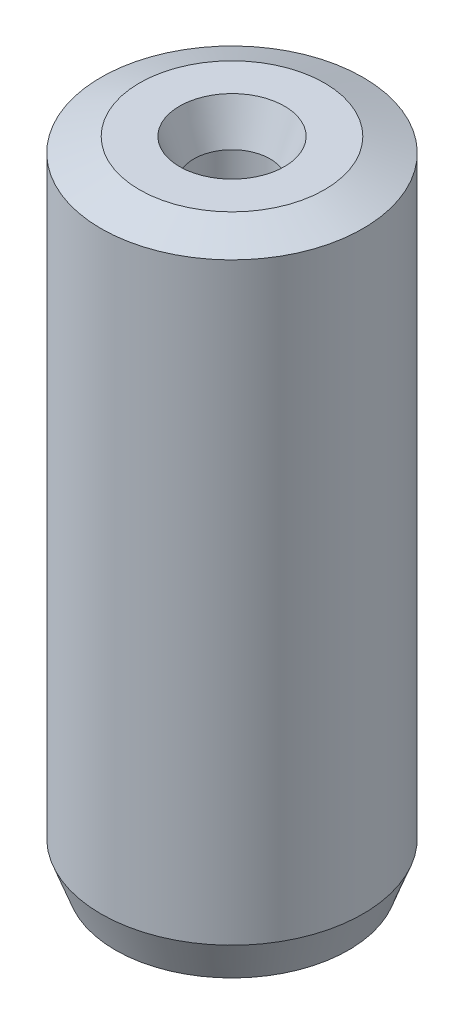
ISO-10303-21;
HEADER;
FILE_DESCRIPTION(('STEP AP214'),'2;1');
FILE_NAME('part.step','',(''),(''),'','','');
FILE_SCHEMA(('AUTOMOTIVE_DESIGN { 1 0 10303 214 1 1 1 1 }'));
ENDSEC;
DATA;
#1=APPLICATION_CONTEXT('core data for automotive mechanical design processes');
#2=APPLICATION_PROTOCOL_DEFINITION('international standard','automotive_design',2000,#1);
#3=PRODUCT_CONTEXT('',#1,'mechanical');
#4=PRODUCT('Part','Part','',(#3));
#5=PRODUCT_RELATED_PRODUCT_CATEGORY('part','',(#4));
#6=PRODUCT_DEFINITION_FORMATION('','',#4);
#7=PRODUCT_DEFINITION_CONTEXT('part definition',#1,'design');
#8=PRODUCT_DEFINITION('design','',#6,#7);
#9=PRODUCT_DEFINITION_SHAPE('','',#8);
#10=(LENGTH_UNIT() NAMED_UNIT(*) SI_UNIT(.MILLI.,.METRE.));
#11=(NAMED_UNIT(*) PLANE_ANGLE_UNIT() SI_UNIT($,.RADIAN.));
#12=(NAMED_UNIT(*) SI_UNIT($,.STERADIAN.) SOLID_ANGLE_UNIT());
#13=UNCERTAINTY_MEASURE_WITH_UNIT(LENGTH_MEASURE(1.E-05),#10,'distance_accuracy_value','');
#14=(GEOMETRIC_REPRESENTATION_CONTEXT(3) GLOBAL_UNCERTAINTY_ASSIGNED_CONTEXT((#13)) GLOBAL_UNIT_ASSIGNED_CONTEXT((#10,
#11,#12)) REPRESENTATION_CONTEXT('',''));
#15=CARTESIAN_POINT('',(0.,0.,0.));
#16=DIRECTION('',(0.,0.,1.));
#17=DIRECTION('',(1.,0.,0.));
#18=AXIS2_PLACEMENT_3D('',#15,#16,#17);
#19=CARTESIAN_POINT('',(0.,24.6691971817461,0.));
#20=DIRECTION('',(0.,-1.,0.));
#21=DIRECTION('',(0.,0.,-1.));
#22=AXIS2_PLACEMENT_3D('',#19,#20,#21);
#23=CYLINDRICAL_SURFACE('',#22,5.);
#24=CARTESIAN_POINT('',(0.,1.4690033079878,0.));
#25=DIRECTION('',(0.,1.,0.));
#26=DIRECTION('',(0.,0.,1.));
#27=AXIS2_PLACEMENT_3D('',#24,#25,#26);
#28=CIRCLE('',#27,5.);
#29=CARTESIAN_POINT('',(0.,1.4690033079878,5.));
#30=VERTEX_POINT('',#29);
#31=EDGE_CURVE('E10',#30,#30,#28,.T.);
#32=ORIENTED_EDGE('',*,*,#31,.T.);
#33=EDGE_LOOP('',(#32));
#34=FACE_BOUND('',#33,.T.);
#35=CARTESIAN_POINT('',(0.,24.1210918360298,0.));
#36=DIRECTION('',(0.,1.,0.));
#37=DIRECTION('',(0.,0.,1.));
#38=AXIS2_PLACEMENT_3D('',#35,#36,#37);
#39=CIRCLE('',#38,5.);
#40=CARTESIAN_POINT('',(0.,24.1210918360298,-5.));
#41=VERTEX_POINT('',#40);
#42=EDGE_CURVE('E50',#41,#41,#39,.F.);
#43=ORIENTED_EDGE('',*,*,#42,.T.);
#44=EDGE_LOOP('',(#43));
#45=FACE_BOUND('',#44,.T.);
#46=ADVANCED_FACE('F39',(#34,#45),#23,.T.);
#47=CARTESIAN_POINT('',(0.,24.6691971817461,0.));
#48=DIRECTION('',(0.,1.,0.));
#49=DIRECTION('',(0.,0.,1.));
#50=AXIS2_PLACEMENT_3D('',#47,#48,#49);
#51=PLANE('',#50);
#52=CARTESIAN_POINT('',(0.,24.6691971817461,0.));
#53=DIRECTION('',(0.,1.,0.));
#54=DIRECTION('',(0.,0.,1.));
#55=AXIS2_PLACEMENT_3D('',#52,#53,#54);
#56=CIRCLE('',#55,2.00139401662723);
#57=CARTESIAN_POINT('',(0.,24.6691971817461,2.00139401662723));
#58=VERTEX_POINT('',#57);
#59=EDGE_CURVE('E58',#58,#58,#56,.F.);
#60=ORIENTED_EDGE('',*,*,#59,.T.);
#61=EDGE_LOOP('',(#60));
#62=FACE_BOUND('',#61,.T.);
#63=CARTESIAN_POINT('',(0.,24.6691971817461,0.));
#64=DIRECTION('',(0.,1.,0.));
#65=DIRECTION('',(0.,0.,1.));
#66=AXIS2_PLACEMENT_3D('',#63,#64,#65);
#67=CIRCLE('',#66,3.53099669201218);
#68=CARTESIAN_POINT('',(0.,24.6691971817461,-3.53099669201218));
#69=VERTEX_POINT('',#68);
#70=EDGE_CURVE('E61',#69,#69,#67,.T.);
#71=ORIENTED_EDGE('',*,*,#70,.T.);
#72=EDGE_LOOP('',(#71));
#73=FACE_BOUND('',#72,.T.);
#74=ADVANCED_FACE('F88',(#62,#73),#51,.T.);
#75=CARTESIAN_POINT('',(0.,0.,0.));
#76=DIRECTION('',(0.,1.,0.));
#77=DIRECTION('',(0.,0.,1.));
#78=AXIS2_PLACEMENT_3D('',#75,#76,#77);
#79=PLANE('',#78);
#80=CARTESIAN_POINT('',(0.,0.,0.));
#81=DIRECTION('',(0.,1.,0.));
#82=DIRECTION('',(0.,0.,1.));
#83=AXIS2_PLACEMENT_3D('',#80,#81,#82);
#84=CIRCLE('',#83,2.92229197889871);
#85=CARTESIAN_POINT('',(0.,0.,-2.92229197889871));
#86=VERTEX_POINT('',#85);
#87=EDGE_CURVE('E51',#86,#86,#84,.T.);
#88=ORIENTED_EDGE('',*,*,#87,.T.);
#89=EDGE_LOOP('',(#88));
#90=FACE_BOUND('',#89,.T.);
#91=CARTESIAN_POINT('',(0.,0.,0.));
#92=DIRECTION('',(0.,1.,0.));
#93=DIRECTION('',(0.,0.,1.));
#94=AXIS2_PLACEMENT_3D('',#91,#92,#93);
#95=CIRCLE('',#94,4.45189465428366);
#96=CARTESIAN_POINT('',(0.,0.,4.45189465428366));
#97=VERTEX_POINT('',#96);
#98=EDGE_CURVE('E54',#97,#97,#95,.F.);
#99=ORIENTED_EDGE('',*,*,#98,.T.);
#100=EDGE_LOOP('',(#99));
#101=FACE_BOUND('',#100,.T.);
#102=ADVANCED_FACE('F83',(#90,#101),#79,.F.);
#103=CARTESIAN_POINT('',(0.,24.6691971817461,0.));
#104=DIRECTION('',(0.,-1.,0.));
#105=DIRECTION('',(0.,0.,-1.));
#106=AXIS2_PLACEMENT_3D('',#103,#104,#105);
#107=CYLINDRICAL_SURFACE('',#106,1.45328867091089);
#108=CARTESIAN_POINT('',(0.,23.2001938737583,0.));
#109=DIRECTION('',(0.,1.,0.));
#110=DIRECTION('',(0.,0.,1.));
#111=AXIS2_PLACEMENT_3D('',#108,#109,#110);
#112=CIRCLE('',#111,1.45328867091089);
#113=CARTESIAN_POINT('',(0.,23.2001938737583,1.45328867091089));
#114=VERTEX_POINT('',#113);
#115=EDGE_CURVE('E67',#114,#114,#112,.T.);
#116=ORIENTED_EDGE('',*,*,#115,.T.);
#117=EDGE_LOOP('',(#116));
#118=FACE_BOUND('',#117,.T.);
#119=CARTESIAN_POINT('',(0.,0.548105345716348,0.));
#120=DIRECTION('',(0.,1.,0.));
#121=DIRECTION('',(0.,0.,1.));
#122=AXIS2_PLACEMENT_3D('',#119,#120,#121);
#123=CIRCLE('',#122,1.45328867091089);
#124=CARTESIAN_POINT('',(0.,0.548105345716348,-1.45328867091089));
#125=VERTEX_POINT('',#124);
#126=EDGE_CURVE('E69',#125,#125,#123,.F.);
#127=ORIENTED_EDGE('',*,*,#126,.T.);
#128=EDGE_LOOP('',(#127));
#129=FACE_BOUND('',#128,.T.);
#130=ADVANCED_FACE('F71',(#118,#129),#107,.F.);
#131=CARTESIAN_POINT('',(0.,23.2001938737583,0.));
#132=DIRECTION('',(0.,1.,0.));
#133=DIRECTION('',(0.,0.,1.));
#134=AXIS2_PLACEMENT_3D('',#131,#132,#133);
#135=CONICAL_SURFACE('',#134,1.45328867091089,0.357115954589851);
#136=ORIENTED_EDGE('',*,*,#59,.F.);
#137=EDGE_LOOP('',(#136));
#138=FACE_BOUND('',#137,.T.);
#139=ORIENTED_EDGE('',*,*,#115,.F.);
#140=EDGE_LOOP('',(#139));
#141=FACE_BOUND('',#140,.T.);
#142=ADVANCED_FACE('F77',(#138,#141),#135,.F.);
#143=CARTESIAN_POINT('',(0.,0.,0.));
#144=DIRECTION('',(0.,-1.,0.));
#145=DIRECTION('',(0.,0.,-1.));
#146=AXIS2_PLACEMENT_3D('',#143,#144,#145);
#147=CONICAL_SURFACE('',#146,2.92229197889871,1.21368037220505);
#148=CARTESIAN_POINT('',(0.,0.548105345716348,-1.45328867091089));
#149=CARTESIAN_POINT('',(0.,0.542395915031803,-1.46859078870243));
#150=CARTESIAN_POINT('',(0.,0.536686484347257,-1.48389290649397));
#151=CARTESIAN_POINT('',(0.,0.525267622978167,-1.51449714207705));
#152=CARTESIAN_POINT('',(0.,0.519558192293622,-1.52979925986859));
#153=CARTESIAN_POINT('',(0.,0.508139330924531,-1.56040349545167));
#154=CARTESIAN_POINT('',(0.,0.502429900239986,-1.57570561324321));
#155=CARTESIAN_POINT('',(0.,0.491011038870895,-1.60630984882629));
#156=CARTESIAN_POINT('',(0.,0.48530160818635,-1.62161196661783));
#157=CARTESIAN_POINT('',(0.,0.473882746817259,-1.65221620220091));
#158=CARTESIAN_POINT('',(0.,0.468173316132714,-1.66751831999245));
#159=CARTESIAN_POINT('',(0.,0.456754454763623,-1.69812255557552));
#160=CARTESIAN_POINT('',(0.,0.451045024079078,-1.71342467336706));
#161=CARTESIAN_POINT('',(0.,0.439626162709987,-1.74402890895014));
#162=CARTESIAN_POINT('',(0.,0.433916732025442,-1.75933102674168));
#163=CARTESIAN_POINT('',(0.,0.422497870656352,-1.78993526232476));
#164=CARTESIAN_POINT('',(0.,0.416788439971806,-1.8052373801163));
#165=CARTESIAN_POINT('',(0.,0.405369578602716,-1.83584161569938));
#166=CARTESIAN_POINT('',(0.,0.39966014791817,-1.85114373349092));
#167=CARTESIAN_POINT('',(0.,0.38824128654908,-1.881747969074));
#168=CARTESIAN_POINT('',(0.,0.382531855864534,-1.89705008686554));
#169=CARTESIAN_POINT('',(0.,0.371112994495444,-1.92765432244862));
#170=CARTESIAN_POINT('',(0.,0.365403563810899,-1.94295644024016));
#171=CARTESIAN_POINT('',(0.,0.353984702441808,-1.97356067582324));
#172=CARTESIAN_POINT('',(0.,0.348275271757263,-1.98886279361478));
#173=CARTESIAN_POINT('',(0.,0.336856410388172,-2.01946702919786));
#174=CARTESIAN_POINT('',(0.,0.331146979703627,-2.0347691469894));
#175=CARTESIAN_POINT('',(0.,0.319728118334536,-2.06537338257248));
#176=CARTESIAN_POINT('',(0.,0.314018687649991,-2.08067550036402));
#177=CARTESIAN_POINT('',(0.,0.3025998262809,-2.1112797359471));
#178=CARTESIAN_POINT('',(0.,0.296890395596355,-2.12658185373864));
#179=CARTESIAN_POINT('',(0.,0.285471534227265,-2.15718608932172));
#180=CARTESIAN_POINT('',(0.,0.279762103542719,-2.17248820711326));
#181=CARTESIAN_POINT('',(0.,0.268343242173629,-2.20309244269634));
#182=CARTESIAN_POINT('',(0.,0.262633811489083,-2.21839456048788));
#183=CARTESIAN_POINT('',(0.,0.251214950119993,-2.24899879607096));
#184=CARTESIAN_POINT('',(0.,0.245505519435447,-2.2643009138625));
#185=CARTESIAN_POINT('',(0.,0.234086658066357,-2.29490514944558));
#186=CARTESIAN_POINT('',(0.,0.228377227381812,-2.31020726723712));
#187=CARTESIAN_POINT('',(0.,0.216958366012721,-2.3408115028202));
#188=CARTESIAN_POINT('',(0.,0.211248935328176,-2.35611362061174));
#189=CARTESIAN_POINT('',(0.,0.199830073959085,-2.38671785619482));
#190=CARTESIAN_POINT('',(0.,0.19412064327454,-2.40201997398636));
#191=CARTESIAN_POINT('',(0.,0.182701781905449,-2.43262420956944));
#192=CARTESIAN_POINT('',(0.,0.176992351220904,-2.44792632736098));
#193=CARTESIAN_POINT('',(0.,0.165573489851813,-2.47853056294405));
#194=CARTESIAN_POINT('',(0.,0.159864059167268,-2.49383268073559));
#195=CARTESIAN_POINT('',(0.,0.148445197798178,-2.52443691631867));
#196=CARTESIAN_POINT('',(0.,0.142735767113632,-2.53973903411021));
#197=CARTESIAN_POINT('',(0.,0.131316905744542,-2.57034326969329));
#198=CARTESIAN_POINT('',(0.,0.125607475059996,-2.58564538748483));
#199=CARTESIAN_POINT('',(0.,0.114188613690906,-2.61624962306791));
#200=CARTESIAN_POINT('',(0.,0.108479183006361,-2.63155174085945));
#201=CARTESIAN_POINT('',(0.,0.09706032163727,-2.66215597644253));
#202=CARTESIAN_POINT('',(0.,0.0913508909527247,-2.67745809423407));
#203=CARTESIAN_POINT('',(0.,0.0799320295836341,-2.70806232981715));
#204=CARTESIAN_POINT('',(0.,0.0742225988990888,-2.72336444760869));
#205=CARTESIAN_POINT('',(0.,0.0628037375299982,-2.75396868319177));
#206=CARTESIAN_POINT('',(0.,0.0570943068454529,-2.76927080098331));
#207=CARTESIAN_POINT('',(0.,0.0456754454763623,-2.79987503656639));
#208=CARTESIAN_POINT('',(0.,0.0399660147918171,-2.81517715435793));
#209=CARTESIAN_POINT('',(0.,0.0285471534227265,-2.84578138994101));
#210=CARTESIAN_POINT('',(0.,0.0228377227381812,-2.86108350773255));
#211=CARTESIAN_POINT('',(0.,0.0114188613690905,-2.89168774331563));
#212=CARTESIAN_POINT('',(0.,0.00570943068454523,-2.90698986110717));
#213=CARTESIAN_POINT('',(0.,0.,-2.92229197889871));
#214=B_SPLINE_CURVE_WITH_KNOTS('',3,(#148,#149,#150,#151,#152,#153,#154,#155,#156,#157,#158,
#159,#160,#161,#162,#163,#164,#165,#166,#167,#168,#169,#170,#171,#172,#173,#174,#175,#176,#177,
#178,#179,#180,#181,#182,#183,#184,#185,#186,#187,#188,#189,#190,#191,#192,#193,#194,#195,#196,
#197,#198,#199,#200,#201,#202,#203,#204,#205,#206,#207,#208,#209,#210,#211,#212,#213),
.UNSPECIFIED.,.F.,.F.,(4,2,2,2,2,2,2,2,2,2,2,2,2,2,2,2,2,2,2,2,2,2,2,2,2,2,2,2,2,2,2,2,4),(0.,
0.0489976700347077,0.0979953400694152,0.146993010104123,0.19599068013883,0.244988350173538,
0.293986020208245,0.342983690242953,0.39198136027766,0.440979030312368,0.489976700347075,
0.538974370381783,0.58797204041649,0.636969710451198,0.685967380485905,0.734965050520613,
0.783962720555321,0.832960390590028,0.881958060624735,0.930955730659443,0.97995340069415,
1.02895107072886,1.07794874076357,1.12694641079827,1.17594408083298,1.22494175086769,
1.2739394209024,1.3229370909371,1.37193476097181,1.42093243100652,1.46993010104123,
1.51892777107593,1.56792544111064),.UNSPECIFIED.);
#215=EDGE_CURVE('BSEAM73',#125,#86,#214,.T.);
#216=ORIENTED_EDGE('',*,*,#126,.F.);
#217=ORIENTED_EDGE('',*,*,#87,.F.);
#218=ORIENTED_EDGE('',*,*,#215,.T.);
#219=ORIENTED_EDGE('',*,*,#215,.F.);
#220=EDGE_LOOP('',(#216,#218,#217,#219));
#221=FACE_BOUND('',#220,.T.);
#222=ADVANCED_FACE('F73',(#221),#147,.F.);
#223=CARTESIAN_POINT('',(0.,1.4690033079878,0.));
#224=DIRECTION('',(0.,1.,0.));
#225=DIRECTION('',(0.,0.,1.));
#226=AXIS2_PLACEMENT_3D('',#223,#224,#225);
#227=CONICAL_SURFACE('',#226,5.,0.357115954589849);
#228=ORIENTED_EDGE('',*,*,#98,.F.);
#229=EDGE_LOOP('',(#228));
#230=FACE_BOUND('',#229,.T.);
#231=ORIENTED_EDGE('',*,*,#31,.F.);
#232=EDGE_LOOP('',(#231));
#233=FACE_BOUND('',#232,.T.);
#234=ADVANCED_FACE('F76',(#230,#233),#227,.T.);
#235=CARTESIAN_POINT('',(0.,24.6691971817461,0.));
#236=DIRECTION('',(0.,-1.,0.));
#237=DIRECTION('',(0.,0.,-1.));
#238=AXIS2_PLACEMENT_3D('',#235,#236,#237);
#239=CONICAL_SURFACE('',#238,3.53099669201218,1.21368037220505);
#240=CARTESIAN_POINT('',(0.,24.1210918360298,-5.));
#241=CARTESIAN_POINT('',(0.,24.1268012667143,-4.98469788220846));
#242=CARTESIAN_POINT('',(0.,24.1325106973989,-4.96939576441692));
#243=CARTESIAN_POINT('',(0.,24.143929558768,-4.93879152883385));
#244=CARTESIAN_POINT('',(0.,24.1496389894525,-4.92348941104231));
#245=CARTESIAN_POINT('',(0.,24.1610578508216,-4.89288517545923));
#246=CARTESIAN_POINT('',(0.,24.1667672815061,-4.87758305766769));
#247=CARTESIAN_POINT('',(0.,24.1781861428752,-4.84697882208461));
#248=CARTESIAN_POINT('',(0.,24.1838955735598,-4.83167670429307));
#249=CARTESIAN_POINT('',(0.,24.1953144349289,-4.80107246870999));
#250=CARTESIAN_POINT('',(0.,24.2010238656134,-4.78577035091845));
#251=CARTESIAN_POINT('',(0.,24.2124427269825,-4.75516611533537));
#252=CARTESIAN_POINT('',(0.,24.2181521576671,-4.73986399754383));
#253=CARTESIAN_POINT('',(0.,24.2295710190361,-4.70925976196075));
#254=CARTESIAN_POINT('',(0.,24.2352804497207,-4.69395764416921));
#255=CARTESIAN_POINT('',(0.,24.2466993110898,-4.66335340858613));
#256=CARTESIAN_POINT('',(0.,24.2524087417743,-4.64805129079459));
#257=CARTESIAN_POINT('',(0.,24.2638276031434,-4.61744705521151));
#258=CARTESIAN_POINT('',(0.,24.269537033828,-4.60214493741997));
#259=CARTESIAN_POINT('',(0.,24.2809558951971,-4.57154070183689));
#260=CARTESIAN_POINT('',(0.,24.2866653258816,-4.55623858404535));
#261=CARTESIAN_POINT('',(0.,24.2980841872507,-4.52563434846227));
#262=CARTESIAN_POINT('',(0.,24.3037936179352,-4.51033223067073));
#263=CARTESIAN_POINT('',(0.,24.3152124793043,-4.47972799508765));
#264=CARTESIAN_POINT('',(0.,24.3209219099889,-4.46442587729611));
#265=CARTESIAN_POINT('',(0.,24.332340771358,-4.43382164171303));
#266=CARTESIAN_POINT('',(0.,24.3380502020425,-4.41851952392149));
#267=CARTESIAN_POINT('',(0.,24.3494690634116,-4.38791528833841));
#268=CARTESIAN_POINT('',(0.,24.3551784940961,-4.37261317054687));
#269=CARTESIAN_POINT('',(0.,24.3665973554652,-4.34200893496379));
#270=CARTESIAN_POINT('',(0.,24.3723067861498,-4.32670681717225));
#271=CARTESIAN_POINT('',(0.,24.3837256475189,-4.29610258158917));
#272=CARTESIAN_POINT('',(0.,24.3894350782034,-4.28080046379763));
#273=CARTESIAN_POINT('',(0.,24.4008539395725,-4.25019622821455));
#274=CARTESIAN_POINT('',(0.,24.4065633702571,-4.23489411042301));
#275=CARTESIAN_POINT('',(0.,24.4179822316261,-4.20428987483993));
#276=CARTESIAN_POINT('',(0.,24.4236916623107,-4.18898775704839));
#277=CARTESIAN_POINT('',(0.,24.4351105236798,-4.15838352146532));
#278=CARTESIAN_POINT('',(0.,24.4408199543643,-4.14308140367378));
#279=CARTESIAN_POINT('',(0.,24.4522388157334,-4.1124771680907));
#280=CARTESIAN_POINT('',(0.,24.457948246418,-4.09717505029916));
#281=CARTESIAN_POINT('',(0.,24.469367107787,-4.06657081471608));
#282=CARTESIAN_POINT('',(0.,24.4750765384716,-4.05126869692454));
#283=CARTESIAN_POINT('',(0.,24.4864953998407,-4.02066446134146));
#284=CARTESIAN_POINT('',(0.,24.4922048305252,-4.00536234354992));
#285=CARTESIAN_POINT('',(0.,24.5036236918943,-3.97475810796684));
#286=CARTESIAN_POINT('',(0.,24.5093331225789,-3.9594559901753));
#287=CARTESIAN_POINT('',(0.,24.520751983948,-3.92885175459222));
#288=CARTESIAN_POINT('',(0.,24.5264614146325,-3.91354963680068));
#289=CARTESIAN_POINT('',(0.,24.5378802760016,-3.8829454012176));
#290=CARTESIAN_POINT('',(0.,24.5435897066861,-3.86764328342606));
#291=CARTESIAN_POINT('',(0.,24.5550085680552,-3.83703904784298));
#292=CARTESIAN_POINT('',(0.,24.5607179987398,-3.82173693005144));
#293=CARTESIAN_POINT('',(0.,24.5721368601089,-3.79113269446836));
#294=CARTESIAN_POINT('',(0.,24.5778462907934,-3.77583057667682));
#295=CARTESIAN_POINT('',(0.,24.5892651521625,-3.74522634109374));
#296=CARTESIAN_POINT('',(0.,24.594974582847,-3.7299242233022));
#297=CARTESIAN_POINT('',(0.,24.6063934442161,-3.69931998771912));
#298=CARTESIAN_POINT('',(0.,24.6121028749007,-3.68401786992758));
#299=CARTESIAN_POINT('',(0.,24.6235217362698,-3.6534136343445));
#300=CARTESIAN_POINT('',(0.,24.6292311669543,-3.63811151655296));
#301=CARTESIAN_POINT('',(0.,24.6406500283234,-3.60750728096988));
#302=CARTESIAN_POINT('',(0.,24.646359459008,-3.59220516317834));
#303=CARTESIAN_POINT('',(0.,24.657778320377,-3.56160092759526));
#304=CARTESIAN_POINT('',(0.,24.6634877510616,-3.54629880980372));
#305=CARTESIAN_POINT('',(0.,24.6691971817461,-3.53099669201218));
#306=B_SPLINE_CURVE_WITH_KNOTS('',3,(#240,#241,#242,#243,#244,#245,#246,#247,#248,#249,#250,
#251,#252,#253,#254,#255,#256,#257,#258,#259,#260,#261,#262,#263,#264,#265,#266,#267,#268,#269,
#270,#271,#272,#273,#274,#275,#276,#277,#278,#279,#280,#281,#282,#283,#284,#285,#286,#287,#288,
#289,#290,#291,#292,#293,#294,#295,#296,#297,#298,#299,#300,#301,#302,#303,#304,#305),
.UNSPECIFIED.,.F.,.F.,(4,2,2,2,2,2,2,2,2,2,2,2,2,2,2,2,2,2,2,2,2,2,2,2,2,2,2,2,2,2,2,2,4),(0.,
0.0489976700347067,0.0979953400694137,0.146993010104122,0.195990680138829,0.244988350173537,
0.293986020208245,0.342983690242951,0.391981360277659,0.440979030312367,0.489976700347075,
0.538974370381783,0.587972040416491,0.636969710451197,0.685967380485904,0.734965050520612,
0.78396272055532,0.832960390590028,0.881958060624736,0.930955730659444,0.97995340069415,
1.02895107072886,1.07794874076357,1.12694641079827,1.17594408083298,1.22494175086769,
1.2739394209024,1.3229370909371,1.37193476097181,1.42093243100652,1.46993010104123,
1.51892777107593,1.56792544111064),.UNSPECIFIED.);
#307=EDGE_CURVE('BSEAM45',#41,#69,#306,.T.);
#308=ORIENTED_EDGE('',*,*,#42,.F.);
#309=ORIENTED_EDGE('',*,*,#70,.F.);
#310=ORIENTED_EDGE('',*,*,#307,.T.);
#311=ORIENTED_EDGE('',*,*,#307,.F.);
#312=EDGE_LOOP('',(#308,#310,#309,#311));
#313=FACE_BOUND('',#312,.T.);
#314=ADVANCED_FACE('F45',(#313),#239,.T.);
#315=CLOSED_SHELL('',(#46,#74,#102,#130,#142,#222,#234,#314));
#316=MANIFOLD_SOLID_BREP('B2',#315);
#317=ADVANCED_BREP_SHAPE_REPRESENTATION('',(#18,#316),#14);
#318=SHAPE_DEFINITION_REPRESENTATION(#9,#317);
ENDSEC;
END-ISO-10303-21;
